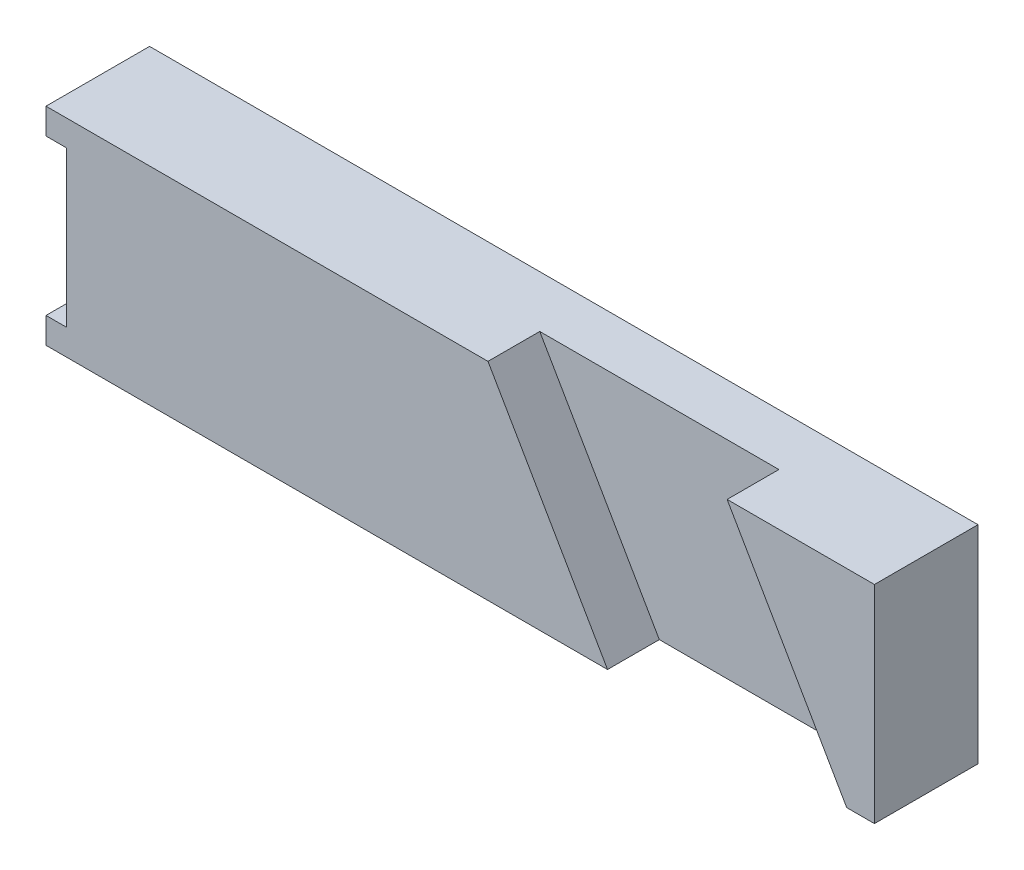
ISO-10303-21;
HEADER;
FILE_DESCRIPTION(('STEP AP214'),'2;1');
FILE_NAME('part.step','',(''),(''),'','','');
FILE_SCHEMA(('AUTOMOTIVE_DESIGN { 1 0 10303 214 1 1 1 1 }'));
ENDSEC;
DATA;
#1=APPLICATION_CONTEXT('core data for automotive mechanical design processes');
#2=APPLICATION_PROTOCOL_DEFINITION('international standard','automotive_design',2000,#1);
#3=PRODUCT_CONTEXT('',#1,'mechanical');
#4=PRODUCT('Part','Part','',(#3));
#5=PRODUCT_RELATED_PRODUCT_CATEGORY('part','',(#4));
#6=PRODUCT_DEFINITION_FORMATION('','',#4);
#7=PRODUCT_DEFINITION_CONTEXT('part definition',#1,'design');
#8=PRODUCT_DEFINITION('design','',#6,#7);
#9=PRODUCT_DEFINITION_SHAPE('','',#8);
#10=(LENGTH_UNIT() NAMED_UNIT(*) SI_UNIT(.MILLI.,.METRE.));
#11=(NAMED_UNIT(*) PLANE_ANGLE_UNIT() SI_UNIT($,.RADIAN.));
#12=(NAMED_UNIT(*) SI_UNIT($,.STERADIAN.) SOLID_ANGLE_UNIT());
#13=UNCERTAINTY_MEASURE_WITH_UNIT(LENGTH_MEASURE(1.E-05),#10,'distance_accuracy_value','');
#14=(GEOMETRIC_REPRESENTATION_CONTEXT(3) GLOBAL_UNCERTAINTY_ASSIGNED_CONTEXT((#13)) GLOBAL_UNIT_ASSIGNED_CONTEXT((#10,
#11,#12)) REPRESENTATION_CONTEXT('',''));
#15=CARTESIAN_POINT('',(0.,0.,0.));
#16=DIRECTION('',(0.,0.,1.));
#17=DIRECTION('',(1.,0.,0.));
#18=AXIS2_PLACEMENT_3D('',#15,#16,#17);
#19=CARTESIAN_POINT('',(0.,0.,10.));
#20=DIRECTION('',(0.,0.,-1.));
#21=DIRECTION('',(-1.,0.,0.));
#22=AXIS2_PLACEMENT_3D('',#19,#20,#21);
#23=PLANE('',#22);
#24=DIRECTION('',(-1.,0.,0.));
#25=VECTOR('',#24,1.);
#26=CARTESIAN_POINT('',(-40.,10.,10.));
#27=LINE('',#26,#25);
#28=CARTESIAN_POINT('',(40.,10.,10.));
#29=VERTEX_POINT('',#28);
#30=CARTESIAN_POINT('',(25.7735026918962,10.,10.));
#31=VERTEX_POINT('',#30);
#32=EDGE_CURVE('E102',#29,#31,#27,.T.);
#33=ORIENTED_EDGE('',*,*,#32,.T.);
#34=DIRECTION('',(-0.500000000000004,0.866025403784436,0.));
#35=VECTOR('',#34,1.);
#36=CARTESIAN_POINT('',(25.7735026918962,10.,10.));
#37=LINE('',#36,#35);
#38=CARTESIAN_POINT('',(37.3205080756889,-9.99999999999999,10.));
#39=VERTEX_POINT('',#38);
#40=EDGE_CURVE('E212',#39,#31,#37,.T.);
#41=ORIENTED_EDGE('',*,*,#40,.F.);
#42=DIRECTION('',(1.,0.,0.));
#43=VECTOR('',#42,1.);
#44=CARTESIAN_POINT('',(-40.,-10.,10.));
#45=LINE('',#44,#43);
#46=CARTESIAN_POINT('',(40.,-10.,10.));
#47=VERTEX_POINT('',#46);
#48=EDGE_CURVE('E60',#39,#47,#45,.T.);
#49=ORIENTED_EDGE('',*,*,#48,.T.);
#50=DIRECTION('',(0.,1.,0.));
#51=VECTOR('',#50,1.);
#52=CARTESIAN_POINT('',(40.,-10.,10.));
#53=LINE('',#52,#51);
#54=EDGE_CURVE('E167',#47,#29,#53,.T.);
#55=ORIENTED_EDGE('',*,*,#54,.T.);
#56=EDGE_LOOP('',(#33,#41,#49,#55));
#57=FACE_BOUND('',#56,.T.);
#58=ADVANCED_FACE('F36',(#57),#23,.F.);
#59=CARTESIAN_POINT('',(40.,-10.,10.));
#60=DIRECTION('',(-1.,0.,0.));
#61=DIRECTION('',(0.,0.,1.));
#62=AXIS2_PLACEMENT_3D('',#59,#60,#61);
#63=PLANE('',#62);
#64=DIRECTION('',(0.,1.,0.));
#65=VECTOR('',#64,1.);
#66=CARTESIAN_POINT('',(40.,-10.,0.));
#67=LINE('',#66,#65);
#68=CARTESIAN_POINT('',(40.,-10.,0.));
#69=VERTEX_POINT('',#68);
#70=CARTESIAN_POINT('',(40.,10.,0.));
#71=VERTEX_POINT('',#70);
#72=EDGE_CURVE('E151',#69,#71,#67,.T.);
#73=ORIENTED_EDGE('',*,*,#72,.T.);
#74=DIRECTION('',(0.,0.,-1.));
#75=VECTOR('',#74,1.);
#76=CARTESIAN_POINT('',(40.,10.,10.));
#77=LINE('',#76,#75);
#78=EDGE_CURVE('E11',#29,#71,#77,.T.);
#79=ORIENTED_EDGE('',*,*,#78,.F.);
#80=ORIENTED_EDGE('',*,*,#54,.F.);
#81=DIRECTION('',(0.,0.,-1.));
#82=VECTOR('',#81,1.);
#83=CARTESIAN_POINT('',(40.,-10.,10.));
#84=LINE('',#83,#82);
#85=EDGE_CURVE('E150',#47,#69,#84,.T.);
#86=ORIENTED_EDGE('',*,*,#85,.T.);
#87=EDGE_LOOP('',(#73,#79,#80,#86));
#88=FACE_BOUND('',#87,.T.);
#89=ADVANCED_FACE('F38',(#88),#63,.F.);
#90=CARTESIAN_POINT('',(-40.,10.,10.));
#91=DIRECTION('',(0.,-1.,0.));
#92=DIRECTION('',(0.,0.,-1.));
#93=AXIS2_PLACEMENT_3D('',#90,#91,#92);
#94=PLANE('',#93);
#95=DIRECTION('',(-1.,0.,0.));
#96=VECTOR('',#95,1.);
#97=CARTESIAN_POINT('',(2.67949192431113,10.,5.));
#98=LINE('',#97,#96);
#99=CARTESIAN_POINT('',(25.7735026918962,10.,5.));
#100=VERTEX_POINT('',#99);
#101=CARTESIAN_POINT('',(2.67949192431113,10.,5.));
#102=VERTEX_POINT('',#101);
#103=EDGE_CURVE('E215',#100,#102,#98,.T.);
#104=ORIENTED_EDGE('',*,*,#103,.F.);
#105=DIRECTION('',(0.,0.,1.));
#106=VECTOR('',#105,1.);
#107=CARTESIAN_POINT('',(25.7735026918962,10.,5.));
#108=LINE('',#107,#106);
#109=EDGE_CURVE('E155',#100,#31,#108,.T.);
#110=ORIENTED_EDGE('',*,*,#109,.T.);
#111=ORIENTED_EDGE('',*,*,#32,.F.);
#112=ORIENTED_EDGE('',*,*,#78,.T.);
#113=DIRECTION('',(-1.,0.,0.));
#114=VECTOR('',#113,1.);
#115=CARTESIAN_POINT('',(-40.,10.,0.));
#116=LINE('',#115,#114);
#117=CARTESIAN_POINT('',(-40.,10.,0.));
#118=VERTEX_POINT('',#117);
#119=EDGE_CURVE('E154',#71,#118,#116,.T.);
#120=ORIENTED_EDGE('',*,*,#119,.T.);
#121=DIRECTION('',(0.,0.,-1.));
#122=VECTOR('',#121,1.);
#123=CARTESIAN_POINT('',(-40.,10.,10.));
#124=LINE('',#123,#122);
#125=CARTESIAN_POINT('',(-40.,10.,10.));
#126=VERTEX_POINT('',#125);
#127=EDGE_CURVE('E44',#126,#118,#124,.T.);
#128=ORIENTED_EDGE('',*,*,#127,.F.);
#129=CARTESIAN_POINT('',(2.67949192431113,10.,10.));
#130=VERTEX_POINT('',#129);
#131=EDGE_CURVE('E201',#130,#126,#27,.T.);
#132=ORIENTED_EDGE('',*,*,#131,.F.);
#133=DIRECTION('',(0.,0.,1.));
#134=VECTOR('',#133,1.);
#135=CARTESIAN_POINT('',(2.67949192431113,10.,5.));
#136=LINE('',#135,#134);
#137=EDGE_CURVE('E51',#102,#130,#136,.T.);
#138=ORIENTED_EDGE('',*,*,#137,.F.);
#139=EDGE_LOOP('',(#104,#110,#111,#112,#120,#128,#132,#138));
#140=FACE_BOUND('',#139,.T.);
#141=ADVANCED_FACE('F235',(#140),#94,.F.);
#142=CARTESIAN_POINT('',(-40.,7.5,10.));
#143=DIRECTION('',(1.,0.,0.));
#144=DIRECTION('',(0.,0.,-1.));
#145=AXIS2_PLACEMENT_3D('',#142,#143,#144);
#146=PLANE('',#145);
#147=DIRECTION('',(0.,-1.,0.));
#148=VECTOR('',#147,1.);
#149=CARTESIAN_POINT('',(-40.,7.5,0.));
#150=LINE('',#149,#148);
#151=CARTESIAN_POINT('',(-40.,7.5,0.));
#152=VERTEX_POINT('',#151);
#153=EDGE_CURVE('E157',#118,#152,#150,.T.);
#154=ORIENTED_EDGE('',*,*,#153,.T.);
#155=DIRECTION('',(0.,0.,-1.));
#156=VECTOR('',#155,1.);
#157=CARTESIAN_POINT('',(-40.,7.5,10.));
#158=LINE('',#157,#156);
#159=CARTESIAN_POINT('',(-40.,7.5,10.));
#160=VERTEX_POINT('',#159);
#161=EDGE_CURVE('E174',#160,#152,#158,.T.);
#162=ORIENTED_EDGE('',*,*,#161,.F.);
#163=DIRECTION('',(0.,-1.,0.));
#164=VECTOR('',#163,1.);
#165=CARTESIAN_POINT('',(-40.,7.5,10.));
#166=LINE('',#165,#164);
#167=EDGE_CURVE('E183',#126,#160,#166,.T.);
#168=ORIENTED_EDGE('',*,*,#167,.F.);
#169=ORIENTED_EDGE('',*,*,#127,.T.);
#170=EDGE_LOOP('',(#154,#162,#168,#169));
#171=FACE_BOUND('',#170,.T.);
#172=ADVANCED_FACE('F181',(#171),#146,.F.);
#173=CARTESIAN_POINT('',(-40.,7.5,10.));
#174=DIRECTION('',(0.,1.,0.));
#175=DIRECTION('',(0.,0.,1.));
#176=AXIS2_PLACEMENT_3D('',#173,#174,#175);
#177=PLANE('',#176);
#178=DIRECTION('',(1.,0.,0.));
#179=VECTOR('',#178,1.);
#180=CARTESIAN_POINT('',(-40.,7.5,0.));
#181=LINE('',#180,#179);
#182=CARTESIAN_POINT('',(-38.,7.5,0.));
#183=VERTEX_POINT('',#182);
#184=EDGE_CURVE('E159',#152,#183,#181,.T.);
#185=ORIENTED_EDGE('',*,*,#184,.T.);
#186=DIRECTION('',(0.,0.,-1.));
#187=VECTOR('',#186,1.);
#188=CARTESIAN_POINT('',(-38.,7.5,10.));
#189=LINE('',#188,#187);
#190=CARTESIAN_POINT('',(-38.,7.5,10.));
#191=VERTEX_POINT('',#190);
#192=EDGE_CURVE('E171',#191,#183,#189,.T.);
#193=ORIENTED_EDGE('',*,*,#192,.F.);
#194=DIRECTION('',(1.,0.,0.));
#195=VECTOR('',#194,1.);
#196=CARTESIAN_POINT('',(-40.,7.5,10.));
#197=LINE('',#196,#195);
#198=EDGE_CURVE('E196',#160,#191,#197,.T.);
#199=ORIENTED_EDGE('',*,*,#198,.F.);
#200=ORIENTED_EDGE('',*,*,#161,.T.);
#201=EDGE_LOOP('',(#185,#193,#199,#200));
#202=FACE_BOUND('',#201,.T.);
#203=ADVANCED_FACE('F192',(#202),#177,.F.);
#204=CARTESIAN_POINT('',(-38.,7.5,10.));
#205=DIRECTION('',(1.,0.,0.));
#206=DIRECTION('',(0.,0.,-1.));
#207=AXIS2_PLACEMENT_3D('',#204,#205,#206);
#208=PLANE('',#207);
#209=DIRECTION('',(0.,-1.,0.));
#210=VECTOR('',#209,1.);
#211=CARTESIAN_POINT('',(-38.,7.5,0.));
#212=LINE('',#211,#210);
#213=CARTESIAN_POINT('',(-38.,-7.5,0.));
#214=VERTEX_POINT('',#213);
#215=EDGE_CURVE('E161',#183,#214,#212,.T.);
#216=ORIENTED_EDGE('',*,*,#215,.T.);
#217=DIRECTION('',(0.,0.,-1.));
#218=VECTOR('',#217,1.);
#219=CARTESIAN_POINT('',(-38.,-7.5,10.));
#220=LINE('',#219,#218);
#221=CARTESIAN_POINT('',(-38.,-7.5,10.));
#222=VERTEX_POINT('',#221);
#223=EDGE_CURVE('E140',#222,#214,#220,.T.);
#224=ORIENTED_EDGE('',*,*,#223,.F.);
#225=DIRECTION('',(0.,-1.,0.));
#226=VECTOR('',#225,1.);
#227=CARTESIAN_POINT('',(-38.,7.5,10.));
#228=LINE('',#227,#226);
#229=EDGE_CURVE('E128',#191,#222,#228,.T.);
#230=ORIENTED_EDGE('',*,*,#229,.F.);
#231=ORIENTED_EDGE('',*,*,#192,.T.);
#232=EDGE_LOOP('',(#216,#224,#230,#231));
#233=FACE_BOUND('',#232,.T.);
#234=ADVANCED_FACE('F195',(#233),#208,.F.);
#235=CARTESIAN_POINT('',(-38.,-7.5,10.));
#236=DIRECTION('',(0.,-1.,0.));
#237=DIRECTION('',(0.,0.,-1.));
#238=AXIS2_PLACEMENT_3D('',#235,#236,#237);
#239=PLANE('',#238);
#240=DIRECTION('',(-1.,0.,0.));
#241=VECTOR('',#240,1.);
#242=CARTESIAN_POINT('',(-38.,-7.5,0.));
#243=LINE('',#242,#241);
#244=CARTESIAN_POINT('',(-40.,-7.5,0.));
#245=VERTEX_POINT('',#244);
#246=EDGE_CURVE('E137',#214,#245,#243,.T.);
#247=ORIENTED_EDGE('',*,*,#246,.T.);
#248=DIRECTION('',(0.,0.,-1.));
#249=VECTOR('',#248,1.);
#250=CARTESIAN_POINT('',(-40.,-7.5,10.));
#251=LINE('',#250,#249);
#252=CARTESIAN_POINT('',(-40.,-7.5,10.));
#253=VERTEX_POINT('',#252);
#254=EDGE_CURVE('E134',#253,#245,#251,.T.);
#255=ORIENTED_EDGE('',*,*,#254,.F.);
#256=DIRECTION('',(-1.,0.,0.));
#257=VECTOR('',#256,1.);
#258=CARTESIAN_POINT('',(-38.,-7.5,10.));
#259=LINE('',#258,#257);
#260=EDGE_CURVE('E120',#222,#253,#259,.T.);
#261=ORIENTED_EDGE('',*,*,#260,.F.);
#262=ORIENTED_EDGE('',*,*,#223,.T.);
#263=EDGE_LOOP('',(#247,#255,#261,#262));
#264=FACE_BOUND('',#263,.T.);
#265=ADVANCED_FACE('F135',(#264),#239,.F.);
#266=CARTESIAN_POINT('',(-40.,-10.,10.));
#267=DIRECTION('',(1.,0.,0.));
#268=DIRECTION('',(0.,0.,-1.));
#269=AXIS2_PLACEMENT_3D('',#266,#267,#268);
#270=PLANE('',#269);
#271=DIRECTION('',(0.,-1.,0.));
#272=VECTOR('',#271,1.);
#273=CARTESIAN_POINT('',(-40.,-10.,0.));
#274=LINE('',#273,#272);
#275=CARTESIAN_POINT('',(-40.,-10.,0.));
#276=VERTEX_POINT('',#275);
#277=EDGE_CURVE('E164',#245,#276,#274,.T.);
#278=ORIENTED_EDGE('',*,*,#277,.T.);
#279=DIRECTION('',(0.,0.,-1.));
#280=VECTOR('',#279,1.);
#281=CARTESIAN_POINT('',(-40.,-10.,10.));
#282=LINE('',#281,#280);
#283=CARTESIAN_POINT('',(-40.,-10.,10.));
#284=VERTEX_POINT('',#283);
#285=EDGE_CURVE('E141',#284,#276,#282,.T.);
#286=ORIENTED_EDGE('',*,*,#285,.F.);
#287=DIRECTION('',(0.,-1.,0.));
#288=VECTOR('',#287,1.);
#289=CARTESIAN_POINT('',(-40.,-10.,10.));
#290=LINE('',#289,#288);
#291=EDGE_CURVE('E125',#253,#284,#290,.T.);
#292=ORIENTED_EDGE('',*,*,#291,.F.);
#293=ORIENTED_EDGE('',*,*,#254,.T.);
#294=EDGE_LOOP('',(#278,#286,#292,#293));
#295=FACE_BOUND('',#294,.T.);
#296=ADVANCED_FACE('F143',(#295),#270,.F.);
#297=CARTESIAN_POINT('',(-40.,-10.,10.));
#298=DIRECTION('',(0.,1.,0.));
#299=DIRECTION('',(0.,0.,1.));
#300=AXIS2_PLACEMENT_3D('',#297,#298,#299);
#301=PLANE('',#300);
#302=ORIENTED_EDGE('',*,*,#48,.F.);
#303=DIRECTION('',(0.,0.,1.));
#304=VECTOR('',#303,1.);
#305=CARTESIAN_POINT('',(37.3205080756889,-9.99999999999999,5.));
#306=LINE('',#305,#304);
#307=CARTESIAN_POINT('',(37.3205080756889,-9.99999999999999,5.));
#308=VERTEX_POINT('',#307);
#309=EDGE_CURVE('E208',#308,#39,#306,.T.);
#310=ORIENTED_EDGE('',*,*,#309,.F.);
#311=DIRECTION('',(1.,0.,0.));
#312=VECTOR('',#311,1.);
#313=CARTESIAN_POINT('',(37.3205080756889,-9.99999999999999,5.));
#314=LINE('',#313,#312);
#315=CARTESIAN_POINT('',(14.2264973081038,-10.,5.));
#316=VERTEX_POINT('',#315);
#317=EDGE_CURVE('E220',#316,#308,#314,.T.);
#318=ORIENTED_EDGE('',*,*,#317,.F.);
#319=DIRECTION('',(0.,0.,1.));
#320=VECTOR('',#319,1.);
#321=CARTESIAN_POINT('',(14.2264973081038,-10.,5.));
#322=LINE('',#321,#320);
#323=CARTESIAN_POINT('',(14.2264973081038,-10.,10.));
#324=VERTEX_POINT('',#323);
#325=EDGE_CURVE('E204',#316,#324,#322,.T.);
#326=ORIENTED_EDGE('',*,*,#325,.T.);
#327=EDGE_CURVE('E146',#284,#324,#45,.T.);
#328=ORIENTED_EDGE('',*,*,#327,.F.);
#329=ORIENTED_EDGE('',*,*,#285,.T.);
#330=DIRECTION('',(1.,0.,0.));
#331=VECTOR('',#330,1.);
#332=CARTESIAN_POINT('',(-40.,-10.,0.));
#333=LINE('',#332,#331);
#334=EDGE_CURVE('E94',#276,#69,#333,.T.);
#335=ORIENTED_EDGE('',*,*,#334,.T.);
#336=ORIENTED_EDGE('',*,*,#85,.F.);
#337=EDGE_LOOP('',(#302,#310,#318,#326,#328,#329,#335,#336));
#338=FACE_BOUND('',#337,.T.);
#339=ADVANCED_FACE('F241',(#338),#301,.F.);
#340=ORIENTED_EDGE('',*,*,#327,.T.);
#341=DIRECTION('',(0.500000000000004,-0.866025403784436,0.));
#342=VECTOR('',#341,1.);
#343=CARTESIAN_POINT('',(2.67949192431113,10.,10.));
#344=LINE('',#343,#342);
#345=EDGE_CURVE('E216',#130,#324,#344,.T.);
#346=ORIENTED_EDGE('',*,*,#345,.F.);
#347=ORIENTED_EDGE('',*,*,#131,.T.);
#348=ORIENTED_EDGE('',*,*,#167,.T.);
#349=ORIENTED_EDGE('',*,*,#198,.T.);
#350=ORIENTED_EDGE('',*,*,#229,.T.);
#351=ORIENTED_EDGE('',*,*,#260,.T.);
#352=ORIENTED_EDGE('',*,*,#291,.T.);
#353=EDGE_LOOP('',(#340,#346,#347,#348,#349,#350,#351,#352));
#354=FACE_BOUND('',#353,.T.);
#355=ADVANCED_FACE('F123',(#354),#23,.F.);
#356=CARTESIAN_POINT('',(0.,0.,0.));
#357=DIRECTION('',(0.,0.,-1.));
#358=DIRECTION('',(-1.,0.,0.));
#359=AXIS2_PLACEMENT_3D('',#356,#357,#358);
#360=PLANE('',#359);
#361=ORIENTED_EDGE('',*,*,#72,.F.);
#362=ORIENTED_EDGE('',*,*,#334,.F.);
#363=ORIENTED_EDGE('',*,*,#277,.F.);
#364=ORIENTED_EDGE('',*,*,#246,.F.);
#365=ORIENTED_EDGE('',*,*,#215,.F.);
#366=ORIENTED_EDGE('',*,*,#184,.F.);
#367=ORIENTED_EDGE('',*,*,#153,.F.);
#368=ORIENTED_EDGE('',*,*,#119,.F.);
#369=EDGE_LOOP('',(#361,#362,#363,#364,#365,#366,#367,#368));
#370=FACE_BOUND('',#369,.T.);
#371=ADVANCED_FACE('F188',(#370),#360,.T.);
#372=CARTESIAN_POINT('',(25.7735026918962,10.,5.));
#373=DIRECTION('',(0.866025403784436,0.500000000000004,0.));
#374=DIRECTION('',(-0.500000000000004,0.866025403784436,0.));
#375=AXIS2_PLACEMENT_3D('',#372,#373,#374);
#376=PLANE('',#375);
#377=ORIENTED_EDGE('',*,*,#40,.T.);
#378=ORIENTED_EDGE('',*,*,#109,.F.);
#379=DIRECTION('',(-0.500000000000004,0.866025403784436,0.));
#380=VECTOR('',#379,1.);
#381=CARTESIAN_POINT('',(25.7735026918962,10.,5.));
#382=LINE('',#381,#380);
#383=EDGE_CURVE('E205',#308,#100,#382,.T.);
#384=ORIENTED_EDGE('',*,*,#383,.F.);
#385=ORIENTED_EDGE('',*,*,#309,.T.);
#386=EDGE_LOOP('',(#377,#378,#384,#385));
#387=FACE_BOUND('',#386,.T.);
#388=ADVANCED_FACE('F248',(#387),#376,.F.);
#389=CARTESIAN_POINT('',(2.67949192431113,10.,5.));
#390=DIRECTION('',(-0.866025403784436,-0.500000000000004,0.));
#391=DIRECTION('',(0.500000000000004,-0.866025403784436,0.));
#392=AXIS2_PLACEMENT_3D('',#389,#390,#391);
#393=PLANE('',#392);
#394=ORIENTED_EDGE('',*,*,#345,.T.);
#395=ORIENTED_EDGE('',*,*,#325,.F.);
#396=DIRECTION('',(0.500000000000004,-0.866025403784436,0.));
#397=VECTOR('',#396,1.);
#398=CARTESIAN_POINT('',(2.67949192431113,10.,5.));
#399=LINE('',#398,#397);
#400=EDGE_CURVE('E223',#102,#316,#399,.T.);
#401=ORIENTED_EDGE('',*,*,#400,.F.);
#402=ORIENTED_EDGE('',*,*,#137,.T.);
#403=EDGE_LOOP('',(#394,#395,#401,#402));
#404=FACE_BOUND('',#403,.T.);
#405=ADVANCED_FACE('F238',(#404),#393,.F.);
#406=CARTESIAN_POINT('',(0.,0.,5.));
#407=DIRECTION('',(0.,0.,-1.));
#408=DIRECTION('',(-1.,0.,0.));
#409=AXIS2_PLACEMENT_3D('',#406,#407,#408);
#410=PLANE('',#409);
#411=ORIENTED_EDGE('',*,*,#103,.T.);
#412=ORIENTED_EDGE('',*,*,#400,.T.);
#413=ORIENTED_EDGE('',*,*,#317,.T.);
#414=ORIENTED_EDGE('',*,*,#383,.T.);
#415=EDGE_LOOP('',(#411,#412,#413,#414));
#416=FACE_BOUND('',#415,.T.);
#417=ADVANCED_FACE('F230',(#416),#410,.F.);
#418=CLOSED_SHELL('',(#58,#89,#141,#172,#203,#234,#265,#296,#339,#355,#371,#388,#405,#417));
#419=MANIFOLD_SOLID_BREP('B2',#418);
#420=ADVANCED_BREP_SHAPE_REPRESENTATION('',(#18,#419),#14);
#421=SHAPE_DEFINITION_REPRESENTATION(#9,#420);
ENDSEC;
END-ISO-10303-21;
